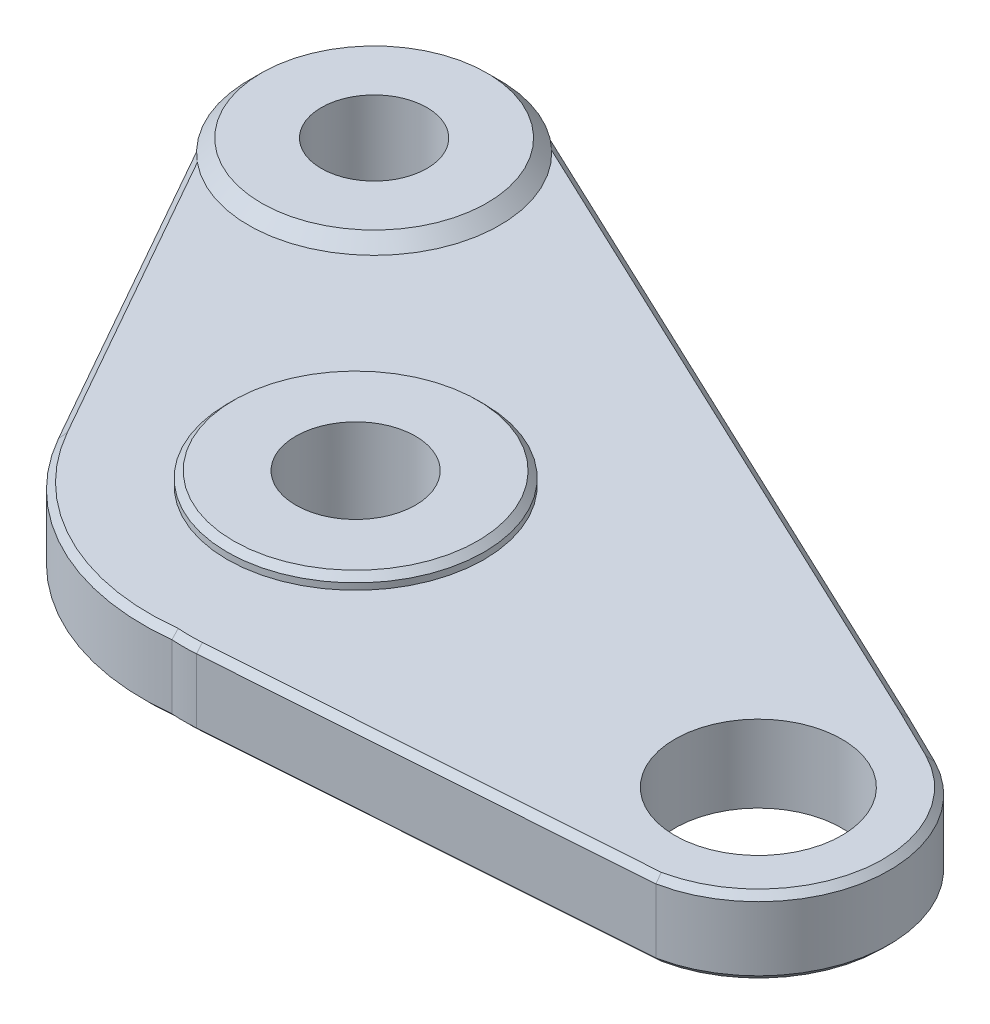
ISO-10303-21;
HEADER;
FILE_DESCRIPTION(('STEP AP214'),'2;1');
FILE_NAME('part.step','',(''),(''),'','','');
FILE_SCHEMA(('AUTOMOTIVE_DESIGN { 1 0 10303 214 1 1 1 1 }'));
ENDSEC;
DATA;
#1=APPLICATION_CONTEXT('core data for automotive mechanical design processes');
#2=APPLICATION_PROTOCOL_DEFINITION('international standard','automotive_design',2000,#1);
#3=PRODUCT_CONTEXT('',#1,'mechanical');
#4=PRODUCT('Part','Part','',(#3));
#5=PRODUCT_RELATED_PRODUCT_CATEGORY('part','',(#4));
#6=PRODUCT_DEFINITION_FORMATION('','',#4);
#7=PRODUCT_DEFINITION_CONTEXT('part definition',#1,'design');
#8=PRODUCT_DEFINITION('design','',#6,#7);
#9=PRODUCT_DEFINITION_SHAPE('','',#8);
#10=(LENGTH_UNIT() NAMED_UNIT(*) SI_UNIT(.MILLI.,.METRE.));
#11=(NAMED_UNIT(*) PLANE_ANGLE_UNIT() SI_UNIT($,.RADIAN.));
#12=(NAMED_UNIT(*) SI_UNIT($,.STERADIAN.) SOLID_ANGLE_UNIT());
#13=UNCERTAINTY_MEASURE_WITH_UNIT(LENGTH_MEASURE(1.E-05),#10,'distance_accuracy_value','');
#14=(GEOMETRIC_REPRESENTATION_CONTEXT(3) GLOBAL_UNCERTAINTY_ASSIGNED_CONTEXT((#13)) GLOBAL_UNIT_ASSIGNED_CONTEXT((#10,
#11,#12)) REPRESENTATION_CONTEXT('',''));
#15=CARTESIAN_POINT('',(0.,0.,0.));
#16=DIRECTION('',(0.,0.,1.));
#17=DIRECTION('',(1.,0.,0.));
#18=AXIS2_PLACEMENT_3D('',#15,#16,#17);
#19=CARTESIAN_POINT('',(-213.823755457334,3.,-894.549990164915));
#20=DIRECTION('',(0.,-1.,0.));
#21=DIRECTION('',(0.,0.,-1.));
#22=AXIS2_PLACEMENT_3D('',#19,#20,#21);
#23=CYLINDRICAL_SURFACE('',#22,2.329855648199);
#24=CARTESIAN_POINT('',(-213.823755457334,3.5,-894.549990164915));
#25=DIRECTION('',(0.,1.,0.));
#26=DIRECTION('',(0.,0.,1.));
#27=AXIS2_PLACEMENT_3D('',#24,#25,#26);
#28=CIRCLE('',#27,2.32985564819897);
#29=CARTESIAN_POINT('',(-213.823755457334,3.5,-892.220134516716));
#30=VERTEX_POINT('',#29);
#31=EDGE_CURVE('E444',#30,#30,#28,.T.);
#32=ORIENTED_EDGE('',*,*,#31,.T.);
#33=EDGE_LOOP('',(#32));
#34=FACE_BOUND('',#33,.T.);
#35=CARTESIAN_POINT('',(-213.823755457334,0.,-894.549990164915));
#36=DIRECTION('',(0.,-1.,0.));
#37=DIRECTION('',(0.,0.,-1.));
#38=AXIS2_PLACEMENT_3D('',#35,#36,#37);
#39=CIRCLE('',#38,2.32985564819897);
#40=CARTESIAN_POINT('',(-213.823755457334,0.,-896.879845813114));
#41=VERTEX_POINT('',#40);
#42=EDGE_CURVE('E451',#41,#41,#39,.T.);
#43=ORIENTED_EDGE('',*,*,#42,.T.);
#44=EDGE_LOOP('',(#43));
#45=FACE_BOUND('',#44,.T.);
#46=ADVANCED_FACE('F35',(#34,#45),#23,.F.);
#47=CARTESIAN_POINT('',(0.,0.,0.));
#48=DIRECTION('',(0.,1.,0.));
#49=DIRECTION('',(0.,0.,1.));
#50=AXIS2_PLACEMENT_3D('',#47,#48,#49);
#51=PLANE('',#50);
#52=CARTESIAN_POINT('',(-195.804631344532,0.,-892.212081269776));
#53=DIRECTION('',(0.,1.,0.));
#54=DIRECTION('',(0.,0.,1.));
#55=AXIS2_PLACEMENT_3D('',#52,#53,#54);
#56=CIRCLE('',#55,3.25135682008187);
#57=CARTESIAN_POINT('',(-195.804631344532,0.,-888.960724449694));
#58=VERTEX_POINT('',#57);
#59=EDGE_CURVE('E433',#58,#58,#56,.T.);
#60=ORIENTED_EDGE('',*,*,#59,.T.);
#61=EDGE_LOOP('',(#60));
#62=FACE_BOUND('',#61,.T.);
#63=CARTESIAN_POINT('',(-224.681131082097,0.,-906.127727053065));
#64=DIRECTION('',(0.,-1.,0.));
#65=DIRECTION('',(0.,0.,-1.));
#66=AXIS2_PLACEMENT_3D('',#63,#64,#65);
#67=CIRCLE('',#66,2.05670900357147);
#68=CARTESIAN_POINT('',(-224.681131082097,0.,-908.184436056637));
#69=VERTEX_POINT('',#68);
#70=EDGE_CURVE('E436',#69,#69,#67,.T.);
#71=ORIENTED_EDGE('',*,*,#70,.F.);
#72=EDGE_LOOP('',(#71));
#73=FACE_BOUND('',#72,.T.);
#74=CARTESIAN_POINT('',(-213.501473140802,0.,-895.082298661492));
#75=DIRECTION('',(0.,1.,0.));
#76=DIRECTION('',(0.,0.,1.));
#77=AXIS2_PLACEMENT_3D('',#74,#75,#76);
#78=CIRCLE('',#77,8.86940842638681);
#79=CARTESIAN_POINT('',(-212.455862171448,0.,-886.274739207544));
#80=VERTEX_POINT('',#79);
#81=CARTESIAN_POINT('',(-221.224016428551,0.,-890.720105290845));
#82=VERTEX_POINT('',#81);
#83=EDGE_CURVE('E514',#80,#82,#78,.F.);
#84=ORIENTED_EDGE('',*,*,#83,.T.);
#85=DIRECTION('',(-0.491824613428475,0.,-0.870694291715486));
#86=VECTOR('',#85,1.);
#87=CARTESIAN_POINT('',(213.720257906825,0.,-120.723064601422));
#88=LINE('',#87,#86);
#89=CARTESIAN_POINT('',(-229.225963751969,0.,-904.886232131346));
#90=VERTEX_POINT('',#89);
#91=EDGE_CURVE('E522',#82,#90,#88,.T.);
#92=ORIENTED_EDGE('',*,*,#91,.T.);
#93=CARTESIAN_POINT('',(-224.681131082097,0.,-906.127727053065));
#94=DIRECTION('',(0.,1.,0.));
#95=DIRECTION('',(0.,0.,1.));
#96=AXIS2_PLACEMENT_3D('',#93,#94,#95);
#97=CIRCLE('',#96,4.71134944976371);
#98=CARTESIAN_POINT('',(-223.430890142522,0.,-910.67016155791));
#99=VERTEX_POINT('',#98);
#100=EDGE_CURVE('E537',#90,#99,#97,.F.);
#101=ORIENTED_EDGE('',*,*,#100,.T.);
#102=DIRECTION('',(0.904115765446797,0.,0.42728758777965));
#103=VECTOR('',#102,1.);
#104=CARTESIAN_POINT('',(-195.549034801812,0.,-897.493120335245));
#105=LINE('',#104,#103);
#106=CARTESIAN_POINT('',(-195.550649035859,0.,-897.493883226678));
#107=VERTEX_POINT('',#106);
#108=EDGE_CURVE('E535',#99,#107,#105,.T.);
#109=ORIENTED_EDGE('',*,*,#108,.T.);
#110=DIRECTION('',(0.897920722726972,0.,0.440157217023045));
#111=VECTOR('',#110,1.);
#112=CARTESIAN_POINT('',(-193.602990997308,0.,-896.539148894055));
#113=LINE('',#112,#111);
#114=CARTESIAN_POINT('',(-193.604600848111,0.,-896.539938036606));
#115=VERTEX_POINT('',#114);
#116=EDGE_CURVE('E533',#107,#115,#113,.T.);
#117=ORIENTED_EDGE('',*,*,#116,.T.);
#118=CARTESIAN_POINT('',(-195.804631344532,0.,-892.212081269776));
#119=DIRECTION('',(0.,1.,0.));
#120=DIRECTION('',(0.,0.,1.));
#121=AXIS2_PLACEMENT_3D('',#118,#119,#120);
#122=CIRCLE('',#121,4.85494370506765);
#123=CARTESIAN_POINT('',(-194.82627024636,0.,-887.456738175849));
#124=VERTEX_POINT('',#123);
#125=EDGE_CURVE('E531',#115,#124,#122,.F.);
#126=ORIENTED_EDGE('',*,*,#125,.T.);
#127=DIRECTION('',(-0.997493341424186,0.,0.0707603972177353));
#128=VECTOR('',#127,1.);
#129=CARTESIAN_POINT('',(-211.5124776384,0.,-886.27304840662));
#130=LINE('',#129,#128);
#131=CARTESIAN_POINT('',(-211.5124776384,0.,-886.27304840662));
#132=VERTEX_POINT('',#131);
#133=EDGE_CURVE('E529',#124,#132,#130,.T.);
#134=ORIENTED_EDGE('',*,*,#133,.T.);
#135=CARTESIAN_POINT('',(-211.972547640031,0.,-892.758551332833));
#136=DIRECTION('',(0.,1.,0.));
#137=DIRECTION('',(0.,0.,1.));
#138=AXIS2_PLACEMENT_3D('',#135,#136,#137);
#139=CIRCLE('',#138,6.50180072074809);
#140=EDGE_CURVE('E519',#132,#80,#139,.F.);
#141=ORIENTED_EDGE('',*,*,#140,.T.);
#142=EDGE_LOOP('',(#84,#92,#101,#109,#117,#126,#134,#141));
#143=FACE_BOUND('',#142,.T.);
#144=ORIENTED_EDGE('',*,*,#42,.F.);
#145=EDGE_LOOP('',(#144));
#146=FACE_BOUND('',#145,.T.);
#147=ADVANCED_FACE('F341',(#62,#73,#143,#146),#51,.F.);
#148=CARTESIAN_POINT('',(0.,3.,0.));
#149=DIRECTION('',(0.,1.,0.));
#150=DIRECTION('',(0.,0.,1.));
#151=AXIS2_PLACEMENT_3D('',#148,#149,#150);
#152=PLANE('',#151);
#153=CARTESIAN_POINT('',(-213.823755457334,3.,-894.549990164915));
#154=DIRECTION('',(0.,1.,0.));
#155=DIRECTION('',(0.,0.,1.));
#156=AXIS2_PLACEMENT_3D('',#153,#154,#155);
#157=CIRCLE('',#156,4.99999999999999);
#158=CARTESIAN_POINT('',(-213.823755457334,3.,-889.549990164915));
#159=VERTEX_POINT('',#158);
#160=EDGE_CURVE('E441',#159,#159,#157,.T.);
#161=ORIENTED_EDGE('',*,*,#160,.F.);
#162=EDGE_LOOP('',(#161));
#163=FACE_BOUND('',#162,.T.);
#164=CARTESIAN_POINT('',(-195.804631344532,3.,-892.212081269776));
#165=DIRECTION('',(0.,1.,0.));
#166=DIRECTION('',(0.,0.,1.));
#167=AXIS2_PLACEMENT_3D('',#164,#165,#166);
#168=CIRCLE('',#167,3.25135682008187);
#169=CARTESIAN_POINT('',(-195.804631344532,3.,-888.960724449694));
#170=VERTEX_POINT('',#169);
#171=EDGE_CURVE('E432',#170,#170,#168,.T.);
#172=ORIENTED_EDGE('',*,*,#171,.F.);
#173=EDGE_LOOP('',(#172));
#174=FACE_BOUND('',#173,.T.);
#175=DIRECTION('',(-0.904115765446797,0.,-0.42728758777965));
#176=VECTOR('',#175,1.);
#177=CARTESIAN_POINT('',(311.014945720974,3.,-658.089595293655));
#178=LINE('',#177,#176);
#179=CARTESIAN_POINT('',(-195.550649035864,3.,-897.493883226681));
#180=VERTEX_POINT('',#179);
#181=CARTESIAN_POINT('',(-221.302349249794,3.,-909.664207300387));
#182=VERTEX_POINT('',#181);
#183=EDGE_CURVE('E175',#180,#182,#178,.T.);
#184=ORIENTED_EDGE('',*,*,#183,.T.);
#185=CARTESIAN_POINT('',(-224.681131082097,3.,-906.127727053065));
#186=DIRECTION('',(0.,1.,0.));
#187=DIRECTION('',(0.,0.,1.));
#188=AXIS2_PLACEMENT_3D('',#185,#186,#187);
#189=CIRCLE('',#188,4.89109999999994);
#190=CARTESIAN_POINT('',(-227.798127864473,3.,-902.358484387932));
#191=VERTEX_POINT('',#190);
#192=EDGE_CURVE('E50',#191,#182,#189,.T.);
#193=ORIENTED_EDGE('',*,*,#192,.F.);
#194=DIRECTION('',(0.491824613428475,0.,0.870694291715486));
#195=VECTOR('',#194,1.);
#196=CARTESIAN_POINT('',(-221.22401642855,3.,-890.720105290845));
#197=LINE('',#196,#195);
#198=CARTESIAN_POINT('',(-221.22401642855,3.,-890.720105290845));
#199=VERTEX_POINT('',#198);
#200=EDGE_CURVE('E174',#191,#199,#197,.T.);
#201=ORIENTED_EDGE('',*,*,#200,.T.);
#202=CARTESIAN_POINT('',(-213.501473140802,3.,-895.082298661492));
#203=DIRECTION('',(0.,1.,0.));
#204=DIRECTION('',(0.,0.,1.));
#205=AXIS2_PLACEMENT_3D('',#202,#203,#204);
#206=CIRCLE('',#205,8.86940842638675);
#207=CARTESIAN_POINT('',(-212.455862171448,3.,-886.274739207544));
#208=VERTEX_POINT('',#207);
#209=EDGE_CURVE('E189',#199,#208,#206,.T.);
#210=ORIENTED_EDGE('',*,*,#209,.T.);
#211=CARTESIAN_POINT('',(-211.972547640031,3.,-892.758551332833));
#212=DIRECTION('',(0.,1.,0.));
#213=DIRECTION('',(0.,0.,1.));
#214=AXIS2_PLACEMENT_3D('',#211,#212,#213);
#215=CIRCLE('',#214,6.50180072074809);
#216=CARTESIAN_POINT('',(-211.5124776384,3.,-886.27304840662));
#217=VERTEX_POINT('',#216);
#218=EDGE_CURVE('E191',#208,#217,#215,.T.);
#219=ORIENTED_EDGE('',*,*,#218,.T.);
#220=DIRECTION('',(0.997493341424186,0.,-0.0707603972177353));
#221=VECTOR('',#220,1.);
#222=CARTESIAN_POINT('',(-63.614882914475,3.,-896.764639794358));
#223=LINE('',#222,#221);
#224=CARTESIAN_POINT('',(-194.82627024636,3.,-887.456738175849));
#225=VERTEX_POINT('',#224);
#226=EDGE_CURVE('E193',#217,#225,#223,.T.);
#227=ORIENTED_EDGE('',*,*,#226,.T.);
#228=CARTESIAN_POINT('',(-195.804631344532,3.,-892.212081269776));
#229=DIRECTION('',(0.,1.,0.));
#230=DIRECTION('',(0.,0.,1.));
#231=AXIS2_PLACEMENT_3D('',#228,#229,#230);
#232=CIRCLE('',#231,4.85494370506764);
#233=CARTESIAN_POINT('',(-193.604600848106,3.,-896.539938036603));
#234=VERTEX_POINT('',#233);
#235=EDGE_CURVE('E195',#225,#234,#232,.T.);
#236=ORIENTED_EDGE('',*,*,#235,.T.);
#237=DIRECTION('',(-0.897920722726972,0.,-0.440157217023045));
#238=VECTOR('',#237,1.);
#239=CARTESIAN_POINT('',(316.827509444087,3.,-646.328119265909));
#240=LINE('',#239,#238);
#241=EDGE_CURVE('E197',#234,#180,#240,.T.);
#242=ORIENTED_EDGE('',*,*,#241,.T.);
#243=EDGE_LOOP('',(#184,#193,#201,#210,#219,#227,#236,#242));
#244=FACE_BOUND('',#243,.T.);
#245=ADVANCED_FACE('F347',(#163,#174,#244),#152,.T.);
#246=CARTESIAN_POINT('',(-224.681131082097,3.,-906.127727053065));
#247=DIRECTION('',(0.,-1.,0.));
#248=DIRECTION('',(0.,0.,-1.));
#249=AXIS2_PLACEMENT_3D('',#246,#247,#248);
#250=CYLINDRICAL_SURFACE('',#249,2.05670900357144);
#251=ORIENTED_EDGE('',*,*,#70,.T.);
#252=EDGE_LOOP('',(#251));
#253=FACE_BOUND('',#252,.T.);
#254=CARTESIAN_POINT('',(-224.681131082097,3.5,-906.127727053065));
#255=DIRECTION('',(0.,1.,0.));
#256=DIRECTION('',(0.,0.,1.));
#257=AXIS2_PLACEMENT_3D('',#254,#255,#256);
#258=CIRCLE('',#257,2.05670900357144);
#259=CARTESIAN_POINT('',(-224.681131082097,3.5,-904.071018049494));
#260=VERTEX_POINT('',#259);
#261=EDGE_CURVE('E448',#260,#260,#258,.T.);
#262=ORIENTED_EDGE('',*,*,#261,.T.);
#263=EDGE_LOOP('',(#262));
#264=FACE_BOUND('',#263,.T.);
#265=ADVANCED_FACE('F354',(#253,#264),#250,.F.);
#266=CARTESIAN_POINT('',(-213.501473140802,3.,-895.082298661492));
#267=DIRECTION('',(0.,-1.,0.));
#268=DIRECTION('',(0.,0.,-1.));
#269=AXIS2_PLACEMENT_3D('',#266,#267,#268);
#270=CYLINDRICAL_SURFACE('',#269,9.11940842638678);
#271=DIRECTION('',(0.,-1.,0.));
#272=VECTOR('',#271,1.);
#273=CARTESIAN_POINT('',(-221.441690001479,3.,-890.597149137488));
#274=LINE('',#273,#272);
#275=CARTESIAN_POINT('',(-221.441690001479,2.75000000000011,-890.597149137488));
#276=VERTEX_POINT('',#275);
#277=CARTESIAN_POINT('',(-221.441690001479,0.250000000000015,-890.597149137488));
#278=VERTEX_POINT('',#277);
#279=EDGE_CURVE('E429',#276,#278,#274,.T.);
#280=ORIENTED_EDGE('',*,*,#279,.T.);
#281=CARTESIAN_POINT('',(-213.501473140802,0.250000000000015,-895.082298661492));
#282=DIRECTION('',(0.,1.,0.));
#283=DIRECTION('',(0.,0.,1.));
#284=AXIS2_PLACEMENT_3D('',#281,#282,#283);
#285=CIRCLE('',#284,9.11940842638678);
#286=CARTESIAN_POINT('',(-212.450307740966,0.250000000000015,-886.023675071264));
#287=VERTEX_POINT('',#286);
#288=EDGE_CURVE('E512',#278,#287,#285,.T.);
#289=ORIENTED_EDGE('',*,*,#288,.T.);
#290=DIRECTION('',(0.,-1.,0.));
#291=VECTOR('',#290,1.);
#292=CARTESIAN_POINT('',(-212.450307740966,3.,-886.023675071264));
#293=LINE('',#292,#291);
#294=CARTESIAN_POINT('',(-212.450307740966,2.75000000000008,-886.023675071264));
#295=VERTEX_POINT('',#294);
#296=EDGE_CURVE('E406',#295,#287,#293,.T.);
#297=ORIENTED_EDGE('',*,*,#296,.F.);
#298=CARTESIAN_POINT('',(-213.501473140802,2.75000000000008,-895.082298661492));
#299=DIRECTION('',(0.,1.,0.));
#300=DIRECTION('',(0.,0.,1.));
#301=AXIS2_PLACEMENT_3D('',#298,#299,#300);
#302=CIRCLE('',#301,9.11940842638678);
#303=EDGE_CURVE('E206',#295,#276,#302,.F.);
#304=ORIENTED_EDGE('',*,*,#303,.T.);
#305=EDGE_LOOP('',(#280,#289,#297,#304));
#306=FACE_BOUND('',#305,.T.);
#307=ADVANCED_FACE('F383',(#306),#270,.T.);
#308=CARTESIAN_POINT('',(-211.972547640031,3.,-892.758551332833));
#309=DIRECTION('',(0.,-1.,0.));
#310=DIRECTION('',(0.,0.,-1.));
#311=AXIS2_PLACEMENT_3D('',#308,#309,#310);
#312=CYLINDRICAL_SURFACE('',#311,6.75180072074806);
#313=ORIENTED_EDGE('',*,*,#296,.T.);
#314=CARTESIAN_POINT('',(-211.972547640031,0.250000000000015,-892.758551332833));
#315=DIRECTION('',(0.,1.,0.));
#316=DIRECTION('',(0.,0.,1.));
#317=AXIS2_PLACEMENT_3D('',#314,#315,#316);
#318=CIRCLE('',#317,6.75180072074806);
#319=CARTESIAN_POINT('',(-211.494787539096,0.250000000000013,-886.023675071264));
#320=VERTEX_POINT('',#319);
#321=EDGE_CURVE('E497',#287,#320,#318,.T.);
#322=ORIENTED_EDGE('',*,*,#321,.T.);
#323=DIRECTION('',(0.,-1.,0.));
#324=VECTOR('',#323,1.);
#325=CARTESIAN_POINT('',(-211.494787539096,3.,-886.023675071264));
#326=LINE('',#325,#324);
#327=CARTESIAN_POINT('',(-211.494787539096,2.75000000000008,-886.023675071264));
#328=VERTEX_POINT('',#327);
#329=EDGE_CURVE('E409',#328,#320,#326,.T.);
#330=ORIENTED_EDGE('',*,*,#329,.F.);
#331=CARTESIAN_POINT('',(-211.972547640031,2.75000000000008,-892.758551332833));
#332=DIRECTION('',(0.,1.,0.));
#333=DIRECTION('',(0.,0.,1.));
#334=AXIS2_PLACEMENT_3D('',#331,#332,#333);
#335=CIRCLE('',#334,6.75180072074806);
#336=EDGE_CURVE('E204',#328,#295,#335,.F.);
#337=ORIENTED_EDGE('',*,*,#336,.T.);
#338=EDGE_LOOP('',(#313,#322,#330,#337));
#339=FACE_BOUND('',#338,.T.);
#340=ADVANCED_FACE('F379',(#339),#312,.T.);
#341=CARTESIAN_POINT('',(-63.5971928151706,3.,-896.515266459002));
#342=DIRECTION('',(0.0707603972177353,0.,0.997493341424186));
#343=DIRECTION('',(0.997493341424186,0.,-0.0707603972177353));
#344=AXIS2_PLACEMENT_3D('',#341,#342,#343);
#345=PLANE('',#344);
#346=ORIENTED_EDGE('',*,*,#329,.T.);
#347=DIRECTION('',(0.997493341424186,0.,-0.0707603972177353));
#348=VECTOR('',#347,1.);
#349=CARTESIAN_POINT('',(-194.792294410404,0.250000000000013,-887.208520121583));
#350=LINE('',#349,#348);
#351=CARTESIAN_POINT('',(-194.792294410404,0.250000000000015,-887.208520121583));
#352=VERTEX_POINT('',#351);
#353=EDGE_CURVE('E493',#320,#352,#350,.T.);
#354=ORIENTED_EDGE('',*,*,#353,.T.);
#355=DIRECTION('',(0.,-1.,0.));
#356=VECTOR('',#355,1.);
#357=CARTESIAN_POINT('',(-194.792294410404,3.,-887.208520121583));
#358=LINE('',#357,#356);
#359=CARTESIAN_POINT('',(-194.792294410404,2.75000000000008,-887.208520121583));
#360=VERTEX_POINT('',#359);
#361=EDGE_CURVE('E414',#360,#352,#358,.T.);
#362=ORIENTED_EDGE('',*,*,#361,.F.);
#363=DIRECTION('',(-0.997493341424186,0.,0.0707603972177353));
#364=VECTOR('',#363,1.);
#365=CARTESIAN_POINT('',(-63.5971928151706,2.75000000000008,-896.515266459002));
#366=LINE('',#365,#364);
#367=EDGE_CURVE('E202',#360,#328,#366,.T.);
#368=ORIENTED_EDGE('',*,*,#367,.T.);
#369=EDGE_LOOP('',(#346,#354,#362,#368));
#370=FACE_BOUND('',#369,.T.);
#371=ADVANCED_FACE('F375',(#370),#345,.T.);
#372=CARTESIAN_POINT('',(-195.804631344532,3.,-892.212081269776));
#373=DIRECTION('',(0.,-1.,0.));
#374=DIRECTION('',(0.,0.,-1.));
#375=AXIS2_PLACEMENT_3D('',#372,#373,#374);
#376=CYLINDRICAL_SURFACE('',#375,5.10494370506767);
#377=ORIENTED_EDGE('',*,*,#361,.T.);
#378=CARTESIAN_POINT('',(-195.804631344532,0.250000000000015,-892.212081269776));
#379=DIRECTION('',(0.,1.,0.));
#380=DIRECTION('',(0.,0.,1.));
#381=AXIS2_PLACEMENT_3D('',#378,#379,#380);
#382=CIRCLE('',#381,5.10494370506767);
#383=CARTESIAN_POINT('',(-193.492951693052,0.249999999999989,-896.763629074737));
#384=VERTEX_POINT('',#383);
#385=EDGE_CURVE('E489',#352,#384,#382,.T.);
#386=ORIENTED_EDGE('',*,*,#385,.T.);
#387=DIRECTION('',(0.,-1.,0.));
#388=VECTOR('',#387,1.);
#389=CARTESIAN_POINT('',(-193.492951693052,3.,-896.763629074737));
#390=LINE('',#389,#388);
#391=CARTESIAN_POINT('',(-193.492951693052,2.75000000000008,-896.763629074737));
#392=VERTEX_POINT('',#391);
#393=EDGE_CURVE('E417',#392,#384,#390,.T.);
#394=ORIENTED_EDGE('',*,*,#393,.F.);
#395=CARTESIAN_POINT('',(-195.804631344532,2.75000000000008,-892.212081269776));
#396=DIRECTION('',(0.,1.,0.));
#397=DIRECTION('',(0.,0.,1.));
#398=AXIS2_PLACEMENT_3D('',#395,#396,#397);
#399=CIRCLE('',#398,5.10494370506767);
#400=EDGE_CURVE('E200',#392,#360,#399,.F.);
#401=ORIENTED_EDGE('',*,*,#400,.T.);
#402=EDGE_LOOP('',(#377,#386,#394,#401));
#403=FACE_BOUND('',#402,.T.);
#404=ADVANCED_FACE('F371',(#403),#376,.T.);
#405=CARTESIAN_POINT('',(316.937548748343,3.,-646.552599446591));
#406=DIRECTION('',(0.440157217023045,0.,-0.897920722726972));
#407=DIRECTION('',(-0.897920722726972,0.,-0.440157217023045));
#408=AXIS2_PLACEMENT_3D('',#405,#406,#407);
#409=PLANE('',#408);
#410=ORIENTED_EDGE('',*,*,#393,.T.);
#411=DIRECTION('',(-0.897920722726972,0.,-0.440157217023045));
#412=VECTOR('',#411,1.);
#413=CARTESIAN_POINT('',(-195.442212904867,0.249999999999988,-897.719149276607));
#414=LINE('',#413,#412);
#415=CARTESIAN_POINT('',(-195.442212904867,0.250000000000024,-897.719149276607));
#416=VERTEX_POINT('',#415);
#417=EDGE_CURVE('E492',#384,#416,#414,.T.);
#418=ORIENTED_EDGE('',*,*,#417,.T.);
#419=DIRECTION('',(0.,-1.,0.));
#420=VECTOR('',#419,1.);
#421=CARTESIAN_POINT('',(-195.442212904867,3.,-897.719149276607));
#422=LINE('',#421,#420);
#423=CARTESIAN_POINT('',(-195.442212904867,2.75000000000004,-897.719149276607));
#424=VERTEX_POINT('',#423);
#425=EDGE_CURVE('E420',#424,#416,#422,.T.);
#426=ORIENTED_EDGE('',*,*,#425,.F.);
#427=DIRECTION('',(0.897920722726972,0.,0.440157217023045));
#428=VECTOR('',#427,1.);
#429=CARTESIAN_POINT('',(316.937548748343,2.75000000000009,-646.552599446591));
#430=LINE('',#429,#428);
#431=EDGE_CURVE('E180',#424,#392,#430,.T.);
#432=ORIENTED_EDGE('',*,*,#431,.T.);
#433=EDGE_LOOP('',(#410,#418,#426,#432));
#434=FACE_BOUND('',#433,.T.);
#435=ADVANCED_FACE('F367',(#434),#409,.T.);
#436=CARTESIAN_POINT('',(311.121767617919,3.,-658.315624235017));
#437=DIRECTION('',(0.42728758777965,0.,-0.904115765446797));
#438=DIRECTION('',(-0.904115765446797,0.,-0.42728758777965));
#439=AXIS2_PLACEMENT_3D('',#436,#437,#438);
#440=PLANE('',#439);
#441=ORIENTED_EDGE('',*,*,#425,.T.);
#442=DIRECTION('',(-0.904115765446797,0.,-0.42728758777965));
#443=VECTOR('',#442,1.);
#444=CARTESIAN_POINT('',(-223.343402799478,0.250000000000023,-910.905328062416));
#445=LINE('',#444,#443);
#446=CARTESIAN_POINT('',(-223.343402799478,0.250000000000015,-910.905328062416));
#447=VERTEX_POINT('',#446);
#448=EDGE_CURVE('E495',#416,#447,#445,.T.);
#449=ORIENTED_EDGE('',*,*,#448,.T.);
#450=DIRECTION('',(0.,-1.,0.));
#451=VECTOR('',#450,1.);
#452=CARTESIAN_POINT('',(-223.343402799478,3.,-910.905328062416));
#453=LINE('',#452,#451);
#454=CARTESIAN_POINT('',(-223.343402799478,2.75000000000004,-910.905328062416));
#455=VERTEX_POINT('',#454);
#456=EDGE_CURVE('E423',#455,#447,#453,.T.);
#457=ORIENTED_EDGE('',*,*,#456,.F.);
#458=DIRECTION('',(0.904115765446797,0.,0.42728758777965));
#459=VECTOR('',#458,1.);
#460=CARTESIAN_POINT('',(311.121767617919,2.75000000000004,-658.315624235017));
#461=LINE('',#460,#459);
#462=EDGE_CURVE('E160',#455,#424,#461,.T.);
#463=ORIENTED_EDGE('',*,*,#462,.T.);
#464=EDGE_LOOP('',(#441,#449,#457,#463));
#465=FACE_BOUND('',#464,.T.);
#466=ADVANCED_FACE('F363',(#465),#440,.T.);
#467=CARTESIAN_POINT('',(-224.681131082097,3.,-906.127727053065));
#468=DIRECTION('',(0.,-1.,0.));
#469=DIRECTION('',(0.,0.,-1.));
#470=AXIS2_PLACEMENT_3D('',#467,#468,#469);
#471=CYLINDRICAL_SURFACE('',#470,4.96134944976373);
#472=ORIENTED_EDGE('',*,*,#456,.T.);
#473=CARTESIAN_POINT('',(-224.681131082097,0.250000000000015,-906.127727053065));
#474=DIRECTION('',(0.,1.,0.));
#475=DIRECTION('',(0.,0.,1.));
#476=AXIS2_PLACEMENT_3D('',#473,#474,#475);
#477=CIRCLE('',#476,4.96134944976373);
#478=CARTESIAN_POINT('',(-229.458732091448,0.250000000000015,-904.789998770447));
#479=VERTEX_POINT('',#478);
#480=EDGE_CURVE('E43',#447,#479,#477,.T.);
#481=ORIENTED_EDGE('',*,*,#480,.T.);
#482=DIRECTION('',(0.,-1.,0.));
#483=VECTOR('',#482,1.);
#484=CARTESIAN_POINT('',(-229.458732091448,3.,-904.789998770447));
#485=LINE('',#484,#483);
#486=CARTESIAN_POINT('',(-229.458732091448,2.75000000000008,-904.789998770447));
#487=VERTEX_POINT('',#486);
#488=EDGE_CURVE('E426',#487,#479,#485,.T.);
#489=ORIENTED_EDGE('',*,*,#488,.F.);
#490=CARTESIAN_POINT('',(-224.681131082097,2.75000000000008,-906.127727053065));
#491=DIRECTION('',(0.,1.,0.));
#492=DIRECTION('',(0.,0.,1.));
#493=AXIS2_PLACEMENT_3D('',#490,#491,#492);
#494=CIRCLE('',#493,4.96134944976373);
#495=EDGE_CURVE('E210',#487,#455,#494,.F.);
#496=ORIENTED_EDGE('',*,*,#495,.T.);
#497=EDGE_LOOP('',(#472,#481,#489,#496));
#498=FACE_BOUND('',#497,.T.);
#499=ADVANCED_FACE('F359',(#498),#471,.T.);
#500=CARTESIAN_POINT('',(213.502584333896,3.,-120.600108448065));
#501=DIRECTION('',(0.870694291715486,0.,-0.491824613428475));
#502=DIRECTION('',(-0.491824613428475,0.,-0.870694291715486));
#503=AXIS2_PLACEMENT_3D('',#500,#501,#502);
#504=PLANE('',#503);
#505=ORIENTED_EDGE('',*,*,#488,.T.);
#506=DIRECTION('',(0.491824613428475,0.,0.870694291715486));
#507=VECTOR('',#506,1.);
#508=CARTESIAN_POINT('',(213.502584333896,0.249999999999991,-120.600108448065));
#509=LINE('',#508,#507);
#510=EDGE_CURVE('E213',#479,#278,#509,.T.);
#511=ORIENTED_EDGE('',*,*,#510,.T.);
#512=ORIENTED_EDGE('',*,*,#279,.F.);
#513=DIRECTION('',(-0.491824613428475,0.,-0.870694291715486));
#514=VECTOR('',#513,1.);
#515=CARTESIAN_POINT('',(-229.458732091448,2.75000000000011,-904.789998770447));
#516=LINE('',#515,#514);
#517=EDGE_CURVE('E208',#276,#487,#516,.T.);
#518=ORIENTED_EDGE('',*,*,#517,.T.);
#519=EDGE_LOOP('',(#505,#511,#512,#518));
#520=FACE_BOUND('',#519,.T.);
#521=ADVANCED_FACE('F355',(#520),#504,.F.);
#522=CARTESIAN_POINT('',(-195.804631344532,3.,-892.212081269776));
#523=DIRECTION('',(0.,-1.,0.));
#524=DIRECTION('',(0.,0.,-1.));
#525=AXIS2_PLACEMENT_3D('',#522,#523,#524);
#526=CYLINDRICAL_SURFACE('',#525,3.25135682008187);
#527=ORIENTED_EDGE('',*,*,#171,.T.);
#528=EDGE_LOOP('',(#527));
#529=FACE_BOUND('',#528,.T.);
#530=ORIENTED_EDGE('',*,*,#59,.F.);
#531=EDGE_LOOP('',(#530));
#532=FACE_BOUND('',#531,.T.);
#533=ADVANCED_FACE('F358',(#529,#532),#526,.F.);
#534=CARTESIAN_POINT('',(-213.823755457334,3.5,-894.549990164915));
#535=DIRECTION('',(0.,1.,0.));
#536=DIRECTION('',(0.,0.,1.));
#537=AXIS2_PLACEMENT_3D('',#534,#535,#536);
#538=PLANE('',#537);
#539=CARTESIAN_POINT('',(-213.823755457334,3.5,-894.549990164915));
#540=DIRECTION('',(0.,1.,0.));
#541=DIRECTION('',(0.,0.,1.));
#542=AXIS2_PLACEMENT_3D('',#539,#540,#541);
#543=CIRCLE('',#542,4.75000000000003);
#544=CARTESIAN_POINT('',(-213.823755457334,3.5,-889.799990164915));
#545=VERTEX_POINT('',#544);
#546=EDGE_CURVE('E404',#545,#545,#543,.T.);
#547=ORIENTED_EDGE('',*,*,#546,.T.);
#548=EDGE_LOOP('',(#547));
#549=FACE_BOUND('',#548,.T.);
#550=ORIENTED_EDGE('',*,*,#31,.F.);
#551=EDGE_LOOP('',(#550));
#552=FACE_BOUND('',#551,.T.);
#553=ADVANCED_FACE('F389',(#549,#552),#538,.T.);
#554=CARTESIAN_POINT('',(-213.823755457334,3.5,-894.549990164915));
#555=DIRECTION('',(0.,-1.,0.));
#556=DIRECTION('',(0.,0.,-1.));
#557=AXIS2_PLACEMENT_3D('',#554,#555,#556);
#558=CYLINDRICAL_SURFACE('',#557,4.99999999999999);
#559=CARTESIAN_POINT('',(-213.823755457334,3.25000000000001,-894.549990164915));
#560=DIRECTION('',(0.,1.,0.));
#561=DIRECTION('',(0.,0.,1.));
#562=AXIS2_PLACEMENT_3D('',#559,#560,#561);
#563=CIRCLE('',#562,4.99999999999999);
#564=CARTESIAN_POINT('',(-213.823755457334,3.25000000000001,-889.549990164915));
#565=VERTEX_POINT('',#564);
#566=EDGE_CURVE('E183',#565,#565,#563,.F.);
#567=ORIENTED_EDGE('',*,*,#566,.T.);
#568=EDGE_LOOP('',(#567));
#569=FACE_BOUND('',#568,.T.);
#570=ORIENTED_EDGE('',*,*,#160,.T.);
#571=EDGE_LOOP('',(#570));
#572=FACE_BOUND('',#571,.T.);
#573=ADVANCED_FACE('F392',(#569,#572),#558,.T.);
#574=CARTESIAN_POINT('',(-213.823755457334,3.5,-894.549990164915));
#575=DIRECTION('',(0.,-1.,0.));
#576=DIRECTION('',(0.,0.,-1.));
#577=AXIS2_PLACEMENT_3D('',#574,#575,#576);
#578=CONICAL_SURFACE('',#577,4.75000000000003,0.785398163397386);
#579=ORIENTED_EDGE('',*,*,#566,.F.);
#580=EDGE_LOOP('',(#579));
#581=FACE_BOUND('',#580,.T.);
#582=ORIENTED_EDGE('',*,*,#546,.F.);
#583=EDGE_LOOP('',(#582));
#584=FACE_BOUND('',#583,.T.);
#585=ADVANCED_FACE('F275',(#581,#584),#578,.T.);
#586=CARTESIAN_POINT('',(-213.501473140802,2.75000000000008,-895.082298661492));
#587=DIRECTION('',(0.,-1.,0.));
#588=DIRECTION('',(0.,0.,-1.));
#589=AXIS2_PLACEMENT_3D('',#586,#587,#588);
#590=CONICAL_SURFACE('',#589,9.11940842638678,0.785398163397587);
#591=CARTESIAN_POINT('',(-212.450307740966,2.75000000000008,-886.023675071264));
#592=CARTESIAN_POINT('',(-212.451243281467,2.79166976026542,-886.065515796613));
#593=CARTESIAN_POINT('',(-212.452173920924,2.83333797372618,-886.107358170639));
#594=CARTESIAN_POINT('',(-212.454025397752,2.9166713070595,-886.191046216066));
#595=CARTESIAN_POINT('',(-212.454946235122,2.95833642693206,-886.232891887467));
#596=CARTESIAN_POINT('',(-212.455862171448,3.00000000000002,-886.274739207544));
#597=B_SPLINE_CURVE_WITH_KNOTS('',3,(#591,#592,#593,#594,#595,#596),.UNSPECIFIED.,.F.,.F.,(4,2,
4),(0.,0.177175092217931,0.354350184525061),.UNSPECIFIED.);
#598=EDGE_CURVE('E261',#208,#295,#597,.F.);
#599=ORIENTED_EDGE('',*,*,#598,.F.);
#600=ORIENTED_EDGE('',*,*,#209,.F.);
#601=DIRECTION('',(0.615673838012586,0.707106781186409,-0.347772519309746));
#602=VECTOR('',#601,1.);
#603=CARTESIAN_POINT('',(-221.441690001479,2.75000000000008,-890.597149137488));
#604=LINE('',#603,#602);
#605=EDGE_CURVE('E268',#276,#199,#604,.T.);
#606=ORIENTED_EDGE('',*,*,#605,.F.);
#607=ORIENTED_EDGE('',*,*,#303,.F.);
#608=EDGE_LOOP('',(#599,#600,#606,#607));
#609=FACE_BOUND('',#608,.T.);
#610=ADVANCED_FACE('F271',(#609),#590,.T.);
#611=CARTESIAN_POINT('',(213.720257906825,3.,-120.723064601422));
#612=DIRECTION('',(-0.615673838012317,0.707106781186686,0.347772519309659));
#613=DIRECTION('',(-0.491824613428475,0.,-0.870694291715486));
#614=AXIS2_PLACEMENT_3D('',#611,#612,#613);
#615=PLANE('',#614);
#616=ORIENTED_EDGE('',*,*,#605,.T.);
#617=ORIENTED_EDGE('',*,*,#200,.F.);
#618=CARTESIAN_POINT('',(-229.225963751969,3.,-904.886232131347));
#619=VERTEX_POINT('',#618);
#620=EDGE_CURVE('E187',#619,#191,#197,.T.);
#621=ORIENTED_EDGE('',*,*,#620,.F.);
#622=CARTESIAN_POINT('',(-229.458732091448,2.75000000000009,-904.789998770447));
#623=CARTESIAN_POINT('',(-229.419966568749,2.79167075499785,-904.80609767126));
#624=CARTESIAN_POINT('',(-229.381186445937,2.83333946565806,-904.822166568342));
#625=CARTESIAN_POINT('',(-229.303596999445,2.91667279899143,-904.854244355309));
#626=CARTESIAN_POINT('',(-229.264787675764,2.95833742166452,-904.870253245194));
#627=CARTESIAN_POINT('',(-229.225963751969,3.,-904.886232131347));
#628=B_SPLINE_CURVE_WITH_KNOTS('',3,(#622,#623,#624,#625,#626,#627),.UNSPECIFIED.,.F.,.F.,(4,2,
4),(0.,0.177441538095385,0.354883079120866),.UNSPECIFIED.);
#629=EDGE_CURVE('E171',#487,#619,#628,.T.);
#630=ORIENTED_EDGE('',*,*,#629,.F.);
#631=ORIENTED_EDGE('',*,*,#517,.F.);
#632=EDGE_LOOP('',(#616,#617,#621,#630,#631));
#633=FACE_BOUND('',#632,.T.);
#634=ADVANCED_FACE('F253',(#633),#615,.T.);
#635=CARTESIAN_POINT('',(-211.972547640031,2.75000000000008,-892.758551332833));
#636=DIRECTION('',(0.,-1.,0.));
#637=DIRECTION('',(0.,0.,-1.));
#638=AXIS2_PLACEMENT_3D('',#635,#636,#637);
#639=CONICAL_SURFACE('',#638,6.75180072074806,0.785398163397547);
#640=ORIENTED_EDGE('',*,*,#598,.T.);
#641=ORIENTED_EDGE('',*,*,#336,.F.);
#642=DIRECTION('',(0.0500351567121435,-0.70710678118648,0.705334305909536));
#643=VECTOR('',#642,1.);
#644=CARTESIAN_POINT('',(-211.5124776384,3.,-886.27304840662));
#645=LINE('',#644,#643);
#646=EDGE_CURVE('E163',#217,#328,#645,.T.);
#647=ORIENTED_EDGE('',*,*,#646,.F.);
#648=ORIENTED_EDGE('',*,*,#218,.F.);
#649=EDGE_LOOP('',(#640,#641,#647,#648));
#650=FACE_BOUND('',#649,.T.);
#651=ADVANCED_FACE('F252',(#650),#639,.T.);
#652=CARTESIAN_POINT('',(-224.681131082097,2.75000000000008,-906.127727053065));
#653=DIRECTION('',(0.,-1.,0.));
#654=DIRECTION('',(0.,0.,-1.));
#655=AXIS2_PLACEMENT_3D('',#652,#653,#654);
#656=CONICAL_SURFACE('',#655,4.96134944976373,0.785398163397578);
#657=ORIENTED_EDGE('',*,*,#629,.T.);
#658=CARTESIAN_POINT('',(-224.681131082097,3.,-906.127727053065));
#659=DIRECTION('',(0.,1.,0.));
#660=DIRECTION('',(0.,0.,1.));
#661=AXIS2_PLACEMENT_3D('',#658,#659,#660);
#662=CIRCLE('',#661,4.71134944976374);
#663=CARTESIAN_POINT('',(-223.430890142523,3.,-910.67016155791));
#664=VERTEX_POINT('',#663);
#665=EDGE_CURVE('E168',#664,#619,#662,.T.);
#666=ORIENTED_EDGE('',*,*,#665,.F.);
#667=CARTESIAN_POINT('',(-223.343402799478,2.75000000000006,-910.905328062416));
#668=CARTESIAN_POINT('',(-223.358026670336,2.79166864399119,-910.86615161307));
#669=CARTESIAN_POINT('',(-223.372629217656,2.83333629923721,-910.826966179766));
#670=CARTESIAN_POINT('',(-223.401791665338,2.91666963257052,-910.74857734493));
#671=CARTESIAN_POINT('',(-223.416351565699,2.9583353106578,-910.709373943399));
#672=CARTESIAN_POINT('',(-223.430890142522,2.99999999999995,-910.67016155791));
#673=B_SPLINE_CURVE_WITH_KNOTS('',3,(#667,#668,#669,#670,#671,#672),.UNSPECIFIED.,.F.,.F.,(4,2,
4),(0.,0.177099787087873,0.354199575584897),.UNSPECIFIED.);
#674=EDGE_CURVE('E153',#455,#664,#673,.T.);
#675=ORIENTED_EDGE('',*,*,#674,.F.);
#676=ORIENTED_EDGE('',*,*,#495,.F.);
#677=EDGE_LOOP('',(#657,#666,#675,#676));
#678=FACE_BOUND('',#677,.T.);
#679=ADVANCED_FACE('F169',(#678),#656,.T.);
#680=CARTESIAN_POINT('',(-63.5971928151706,2.75000000000008,-896.515266459002));
#681=DIRECTION('',(-0.0500351567121096,-0.707106781186614,-0.705334305909404));
#682=DIRECTION('',(-0.997493341424186,0.,0.0707603972177353));
#683=AXIS2_PLACEMENT_3D('',#680,#681,#682);
#684=PLANE('',#683);
#685=ORIENTED_EDGE('',*,*,#646,.T.);
#686=ORIENTED_EDGE('',*,*,#367,.F.);
#687=CARTESIAN_POINT('',(-194.792294410404,2.75000000000008,-887.208520121583));
#688=CARTESIAN_POINT('',(-194.797922985665,2.79166778426724,-887.249893334147));
#689=CARTESIAN_POINT('',(-194.803568592952,2.83333500969003,-887.291264778241));
#690=CARTESIAN_POINT('',(-194.814893871604,2.91666834302336,-887.374004129663));
#691=CARTESIAN_POINT('',(-194.820573542969,2.95833445093389,-887.415372036991));
#692=CARTESIAN_POINT('',(-194.82627024636,3.00000000000004,-887.456738175849));
#693=B_SPLINE_CURVE_WITH_KNOTS('',3,(#687,#688,#689,#690,#691,#692),.UNSPECIFIED.,.F.,.F.,(4,2,
4),(0.,0.176965088314878,0.353930177379299),.UNSPECIFIED.);
#694=EDGE_CURVE('E164',#225,#360,#693,.F.);
#695=ORIENTED_EDGE('',*,*,#694,.F.);
#696=ORIENTED_EDGE('',*,*,#226,.F.);
#697=EDGE_LOOP('',(#685,#686,#695,#696));
#698=FACE_BOUND('',#697,.T.);
#699=ADVANCED_FACE('F233',(#698),#684,.F.);
#700=CARTESIAN_POINT('',(311.121767617919,2.75000000000008,-658.315624235017));
#701=DIRECTION('',(-0.302137950835779,-0.707106781186674,0.639306388724982));
#702=DIRECTION('',(0.904115765446797,0.,0.42728758777965));
#703=AXIS2_PLACEMENT_3D('',#700,#701,#702);
#704=PLANE('',#703);
#705=ORIENTED_EDGE('',*,*,#674,.T.);
#706=EDGE_CURVE('E158',#182,#664,#178,.T.);
#707=ORIENTED_EDGE('',*,*,#706,.F.);
#708=ORIENTED_EDGE('',*,*,#183,.F.);
#709=DIRECTION('',(0.306699783527318,-0.707097765026303,-0.637140481745669));
#710=VECTOR('',#709,1.);
#711=CARTESIAN_POINT('',(-194.574440864129,0.749347559041489,-899.521865567174));
#712=LINE('',#711,#710);
#713=EDGE_CURVE('E221',#424,#180,#712,.F.);
#714=ORIENTED_EDGE('',*,*,#713,.F.);
#715=ORIENTED_EDGE('',*,*,#462,.F.);
#716=EDGE_LOOP('',(#705,#707,#708,#714,#715));
#717=FACE_BOUND('',#716,.T.);
#718=ADVANCED_FACE('F155',(#717),#704,.F.);
#719=CARTESIAN_POINT('',(-195.804631344532,2.75000000000008,-892.212081269776));
#720=DIRECTION('',(0.,-1.,0.));
#721=DIRECTION('',(0.,0.,-1.));
#722=AXIS2_PLACEMENT_3D('',#719,#720,#721);
#723=CONICAL_SURFACE('',#722,5.10494370506767,0.785398163397577);
#724=ORIENTED_EDGE('',*,*,#694,.T.);
#725=ORIENTED_EDGE('',*,*,#400,.F.);
#726=CARTESIAN_POINT('',(-193.492951693052,2.75000000000008,-896.763629074737));
#727=CARTESIAN_POINT('',(-193.5115565235,2.79166668011529,-896.726345572001));
#728=CARTESIAN_POINT('',(-193.530163034978,2.83333335350569,-896.68906290079));
#729=CARTESIAN_POINT('',(-193.567379419994,2.91666668683898,-896.61449922141));
#730=CARTESIAN_POINT('',(-193.585989293531,2.95833334678188,-896.577218213243));
#731=CARTESIAN_POINT('',(-193.604600848099,2.99999999999997,-896.539938036599));
#732=B_SPLINE_CURVE_WITH_KNOTS('',3,(#726,#727,#728,#729,#730,#731),.UNSPECIFIED.,.F.,.F.,(4,2,
4),(0.,0.176778968266699,0.353557936542425),.UNSPECIFIED.);
#733=EDGE_CURVE('E214',#234,#392,#732,.F.);
#734=ORIENTED_EDGE('',*,*,#733,.F.);
#735=ORIENTED_EDGE('',*,*,#235,.F.);
#736=EDGE_LOOP('',(#724,#725,#734,#735));
#737=FACE_BOUND('',#736,.T.);
#738=ADVANCED_FACE('F224',(#737),#723,.T.);
#739=CARTESIAN_POINT('',(316.937548748343,2.75000000000008,-646.552599446591));
#740=DIRECTION('',(-0.311238152945121,-0.707106781186715,0.634925832008017));
#741=DIRECTION('',(0.897920722726972,0.,0.440157217023045));
#742=AXIS2_PLACEMENT_3D('',#739,#740,#741);
#743=PLANE('',#742);
#744=ORIENTED_EDGE('',*,*,#713,.T.);
#745=ORIENTED_EDGE('',*,*,#241,.F.);
#746=ORIENTED_EDGE('',*,*,#733,.T.);
#747=ORIENTED_EDGE('',*,*,#431,.F.);
#748=EDGE_LOOP('',(#744,#745,#746,#747));
#749=FACE_BOUND('',#748,.T.);
#750=ADVANCED_FACE('F227',(#749),#743,.F.);
#751=CARTESIAN_POINT('',(-195.804631344532,0.,-892.212081269776));
#752=DIRECTION('',(0.,1.,0.));
#753=DIRECTION('',(0.,0.,1.));
#754=AXIS2_PLACEMENT_3D('',#751,#752,#753);
#755=CONICAL_SURFACE('',#754,4.85494370506771,0.785398163397339);
#756=CARTESIAN_POINT('',(-194.792294410404,0.250000000000014,-887.208520121583));
#757=CARTESIAN_POINT('',(-194.797922985665,0.208332215732839,-887.249893334147));
#758=CARTESIAN_POINT('',(-194.803568592952,0.166664990310034,-887.291264778241));
#759=CARTESIAN_POINT('',(-194.814893871604,0.083331656976684,-887.374004129663));
#760=CARTESIAN_POINT('',(-194.820573542968,0.0416655490661437,-887.415372036991));
#761=CARTESIAN_POINT('',(-194.82627024636,0.,-887.456738175849));
#762=B_SPLINE_CURVE_WITH_KNOTS('',3,(#756,#757,#758,#759,#760,#761),.UNSPECIFIED.,.F.,.F.,(4,2,
4),(0.,0.176965088314893,0.353930177379327),.UNSPECIFIED.);
#763=EDGE_CURVE('E325',#124,#352,#762,.F.);
#764=ORIENTED_EDGE('',*,*,#763,.F.);
#765=ORIENTED_EDGE('',*,*,#125,.F.);
#766=CARTESIAN_POINT('',(-193.492951693052,0.250000000000002,-896.763629074737));
#767=CARTESIAN_POINT('',(-193.5115565235,0.208333319884774,-896.726345572001));
#768=CARTESIAN_POINT('',(-193.530163034979,0.166666646494356,-896.68906290079));
#769=CARTESIAN_POINT('',(-193.567379419998,0.0833333131610113,-896.614499221413));
#770=CARTESIAN_POINT('',(-193.585989293538,0.0416666532180837,-896.577218213247));
#771=CARTESIAN_POINT('',(-193.604600848109,0.,-896.539938036605));
#772=B_SPLINE_CURVE_WITH_KNOTS('',3,(#766,#767,#768,#769,#770,#771),.UNSPECIFIED.,.F.,.F.,(4,2,
4),(0.,0.176778968266726,0.353557936542497),.UNSPECIFIED.);
#773=EDGE_CURVE('E222',#384,#115,#772,.T.);
#774=ORIENTED_EDGE('',*,*,#773,.F.);
#775=ORIENTED_EDGE('',*,*,#385,.F.);
#776=EDGE_LOOP('',(#764,#765,#774,#775));
#777=FACE_BOUND('',#776,.T.);
#778=ADVANCED_FACE('F231',(#777),#755,.T.);
#779=CARTESIAN_POINT('',(316.827509444087,0.,-646.328119265909));
#780=DIRECTION('',(0.31123815294527,-0.707106781186376,-0.634925832008322));
#781=DIRECTION('',(-0.897920722726972,0.,-0.440157217023045));
#782=AXIS2_PLACEMENT_3D('',#779,#780,#781);
#783=PLANE('',#782);
#784=ORIENTED_EDGE('',*,*,#773,.T.);
#785=ORIENTED_EDGE('',*,*,#116,.F.);
#786=DIRECTION('',(-0.306699783500705,-0.707097765026537,0.63714048175822));
#787=VECTOR('',#786,1.);
#788=CARTESIAN_POINT('',(-194.682874234979,2.00065880464951,-899.296605251374));
#789=LINE('',#788,#787);
#790=EDGE_CURVE('E563',#416,#107,#789,.T.);
#791=ORIENTED_EDGE('',*,*,#790,.F.);
#792=ORIENTED_EDGE('',*,*,#417,.F.);
#793=EDGE_LOOP('',(#784,#785,#791,#792));
#794=FACE_BOUND('',#793,.T.);
#795=ADVANCED_FACE('F320',(#794),#783,.T.);
#796=CARTESIAN_POINT('',(-63.614882914475,0.,-896.764639794358));
#797=DIRECTION('',(0.0500351567121187,-0.707106781186485,0.705334305909532));
#798=DIRECTION('',(0.997493341424186,0.,-0.0707603972177353));
#799=AXIS2_PLACEMENT_3D('',#796,#797,#798);
#800=PLANE('',#799);
#801=ORIENTED_EDGE('',*,*,#763,.T.);
#802=ORIENTED_EDGE('',*,*,#353,.F.);
#803=DIRECTION('',(0.0500351567121345,0.707106781186606,0.70533430590941));
#804=VECTOR('',#803,1.);
#805=CARTESIAN_POINT('',(-211.5124776384,0.,-886.27304840662));
#806=LINE('',#805,#804);
#807=EDGE_CURVE('E303',#132,#320,#806,.T.);
#808=ORIENTED_EDGE('',*,*,#807,.F.);
#809=ORIENTED_EDGE('',*,*,#133,.F.);
#810=EDGE_LOOP('',(#801,#802,#808,#809));
#811=FACE_BOUND('',#810,.T.);
#812=ADVANCED_FACE('F314',(#811),#800,.T.);
#813=CARTESIAN_POINT('',(311.014945720974,0.,-658.089595293655));
#814=DIRECTION('',(0.302137950835834,-0.707106781186545,-0.639306388725098));
#815=DIRECTION('',(-0.904115765446797,0.,-0.42728758777965));
#816=AXIS2_PLACEMENT_3D('',#813,#814,#815);
#817=PLANE('',#816);
#818=ORIENTED_EDGE('',*,*,#790,.T.);
#819=ORIENTED_EDGE('',*,*,#108,.F.);
#820=CARTESIAN_POINT('',(-223.343402799478,0.250000000000019,-910.905328062416));
#821=CARTESIAN_POINT('',(-223.358026670336,0.208331356008871,-910.86615161307));
#822=CARTESIAN_POINT('',(-223.372629217656,0.166663700762839,-910.826966179766));
#823=CARTESIAN_POINT('',(-223.401791665338,0.0833303674294965,-910.74857734493));
#824=CARTESIAN_POINT('',(-223.416351565699,0.0416646893422013,-910.709373943399));
#825=CARTESIAN_POINT('',(-223.430890142523,0.,-910.67016155791));
#826=B_SPLINE_CURVE_WITH_KNOTS('',3,(#820,#821,#822,#823,#824,#825),.UNSPECIFIED.,.F.,.F.,(4,2,
4),(0.,0.177099787087966,0.354199575584994),.UNSPECIFIED.);
#827=EDGE_CURVE('E296',#447,#99,#826,.T.);
#828=ORIENTED_EDGE('',*,*,#827,.F.);
#829=ORIENTED_EDGE('',*,*,#448,.F.);
#830=EDGE_LOOP('',(#818,#819,#828,#829));
#831=FACE_BOUND('',#830,.T.);
#832=ADVANCED_FACE('F310',(#831),#817,.T.);
#833=CARTESIAN_POINT('',(-211.972547640031,0.,-892.758551332833));
#834=DIRECTION('',(0.,1.,0.));
#835=DIRECTION('',(0.,0.,1.));
#836=AXIS2_PLACEMENT_3D('',#833,#834,#835);
#837=CONICAL_SURFACE('',#836,6.50180072074809,0.785398163397365);
#838=ORIENTED_EDGE('',*,*,#807,.T.);
#839=ORIENTED_EDGE('',*,*,#321,.F.);
#840=CARTESIAN_POINT('',(-212.450307740966,0.250000000000015,-886.023675071264));
#841=CARTESIAN_POINT('',(-212.451243281467,0.208330239734674,-886.065515796613));
#842=CARTESIAN_POINT('',(-212.452173920924,0.166662026273925,-886.107358170639));
#843=CARTESIAN_POINT('',(-212.454025397752,0.0833286929406069,-886.191046216065));
#844=CARTESIAN_POINT('',(-212.454946235122,0.041663573068039,-886.232891887466));
#845=CARTESIAN_POINT('',(-212.455862171448,0.,-886.274739207544));
#846=B_SPLINE_CURVE_WITH_KNOTS('',3,(#840,#841,#842,#843,#844,#845),.UNSPECIFIED.,.F.,.F.,(4,2,
4),(0.,0.17717509221783,0.354350184524982),.UNSPECIFIED.);
#847=EDGE_CURVE('E304',#80,#287,#846,.F.);
#848=ORIENTED_EDGE('',*,*,#847,.F.);
#849=ORIENTED_EDGE('',*,*,#140,.F.);
#850=EDGE_LOOP('',(#838,#839,#848,#849));
#851=FACE_BOUND('',#850,.T.);
#852=ADVANCED_FACE('F282',(#851),#837,.T.);
#853=CARTESIAN_POINT('',(-224.681131082097,0.,-906.127727053065));
#854=DIRECTION('',(0.,1.,0.));
#855=DIRECTION('',(0.,0.,1.));
#856=AXIS2_PLACEMENT_3D('',#853,#854,#855);
#857=CONICAL_SURFACE('',#856,4.71134944976374,0.785398163397396);
#858=ORIENTED_EDGE('',*,*,#827,.T.);
#859=ORIENTED_EDGE('',*,*,#100,.F.);
#860=CARTESIAN_POINT('',(-229.225963751969,0.,-904.886232131346));
#861=CARTESIAN_POINT('',(-229.264787675764,0.0416625783354979,-904.870253245193));
#862=CARTESIAN_POINT('',(-229.303596999445,0.0833272010086097,-904.854244355309));
#863=CARTESIAN_POINT('',(-229.381186445937,0.166660534342009,-904.822166568342));
#864=CARTESIAN_POINT('',(-229.419966568749,0.20832924500223,-904.80609767126));
#865=CARTESIAN_POINT('',(-229.458732091448,0.249999999999997,-904.789998770447));
#866=B_SPLINE_CURVE_WITH_KNOTS('',3,(#860,#861,#862,#863,#864,#865),.UNSPECIFIED.,.F.,.F.,(4,2,
4),(0.,0.17744154102552,0.354883079120908),.UNSPECIFIED.);
#867=EDGE_CURVE('E289',#479,#90,#866,.F.);
#868=ORIENTED_EDGE('',*,*,#867,.F.);
#869=ORIENTED_EDGE('',*,*,#480,.F.);
#870=EDGE_LOOP('',(#858,#859,#868,#869));
#871=FACE_BOUND('',#870,.T.);
#872=ADVANCED_FACE('F277',(#871),#857,.T.);
#873=CARTESIAN_POINT('',(-213.501473140802,0.,-895.082298661492));
#874=DIRECTION('',(0.,1.,0.));
#875=DIRECTION('',(0.,0.,1.));
#876=AXIS2_PLACEMENT_3D('',#873,#874,#875);
#877=CONICAL_SURFACE('',#876,8.86940842638681,0.785398163397356);
#878=ORIENTED_EDGE('',*,*,#847,.T.);
#879=ORIENTED_EDGE('',*,*,#288,.F.);
#880=DIRECTION('',(-0.615673838012377,0.707106781186606,0.347772519309716));
#881=VECTOR('',#880,1.);
#882=CARTESIAN_POINT('',(-221.224016428551,0.,-890.720105290845));
#883=LINE('',#882,#881);
#884=EDGE_CURVE('E447',#82,#278,#883,.T.);
#885=ORIENTED_EDGE('',*,*,#884,.F.);
#886=ORIENTED_EDGE('',*,*,#83,.F.);
#887=EDGE_LOOP('',(#878,#879,#885,#886));
#888=FACE_BOUND('',#887,.T.);
#889=ADVANCED_FACE('F281',(#888),#877,.T.);
#890=CARTESIAN_POINT('',(213.502584333896,0.250000000000015,-120.600108448065));
#891=DIRECTION('',(0.615673838012467,0.707106781186514,-0.347772519309744));
#892=DIRECTION('',(0.491824613428475,0.,0.870694291715486));
#893=AXIS2_PLACEMENT_3D('',#890,#891,#892);
#894=PLANE('',#893);
#895=ORIENTED_EDGE('',*,*,#867,.T.);
#896=ORIENTED_EDGE('',*,*,#91,.F.);
#897=ORIENTED_EDGE('',*,*,#884,.T.);
#898=ORIENTED_EDGE('',*,*,#510,.F.);
#899=EDGE_LOOP('',(#895,#896,#897,#898));
#900=FACE_BOUND('',#899,.T.);
#901=ADVANCED_FACE('F284',(#900),#894,.F.);
#902=CARTESIAN_POINT('',(-224.681131082097,3.5,-906.127727053065));
#903=DIRECTION('',(0.,1.,0.));
#904=DIRECTION('',(0.,0.,1.));
#905=AXIS2_PLACEMENT_3D('',#902,#903,#904);
#906=PLANE('',#905);
#907=CARTESIAN_POINT('',(-224.681131082097,3.5,-906.127727053065));
#908=DIRECTION('',(0.,1.,0.));
#909=DIRECTION('',(0.,0.,1.));
#910=AXIS2_PLACEMENT_3D('',#907,#908,#909);
#911=CIRCLE('',#910,4.39109999999987);
#912=CARTESIAN_POINT('',(-224.681131082097,3.5,-901.736627053065));
#913=VERTEX_POINT('',#912);
#914=EDGE_CURVE('E11',#913,#913,#911,.T.);
#915=ORIENTED_EDGE('',*,*,#914,.T.);
#916=EDGE_LOOP('',(#915));
#917=FACE_BOUND('',#916,.T.);
#918=ORIENTED_EDGE('',*,*,#261,.F.);
#919=EDGE_LOOP('',(#918));
#920=FACE_BOUND('',#919,.T.);
#921=ADVANCED_FACE('F458',(#917,#920),#906,.T.);
#922=CARTESIAN_POINT('',(-224.681131082097,3.,-906.127727053065));
#923=DIRECTION('',(0.,1.,0.));
#924=DIRECTION('',(0.,0.,1.));
#925=AXIS2_PLACEMENT_3D('',#922,#923,#924);
#926=PLANE('',#925);
#927=ORIENTED_EDGE('',*,*,#620,.T.);
#928=EDGE_CURVE('E179',#182,#191,#189,.T.);
#929=ORIENTED_EDGE('',*,*,#928,.F.);
#930=ORIENTED_EDGE('',*,*,#706,.T.);
#931=ORIENTED_EDGE('',*,*,#665,.T.);
#932=EDGE_LOOP('',(#927,#929,#930,#931));
#933=FACE_BOUND('',#932,.T.);
#934=ADVANCED_FACE('F178',(#933),#926,.F.);
#935=CARTESIAN_POINT('',(-224.681131082097,3.5,-906.127727053065));
#936=DIRECTION('',(0.,-1.,0.));
#937=DIRECTION('',(0.,0.,-1.));
#938=AXIS2_PLACEMENT_3D('',#935,#936,#937);
#939=CONICAL_SURFACE('',#938,4.39109999999987,0.785398163397493);
#940=ORIENTED_EDGE('',*,*,#192,.T.);
#941=ORIENTED_EDGE('',*,*,#928,.T.);
#942=EDGE_LOOP('',(#940,#941));
#943=FACE_BOUND('',#942,.T.);
#944=ORIENTED_EDGE('',*,*,#914,.F.);
#945=EDGE_LOOP('',(#944));
#946=FACE_BOUND('',#945,.T.);
#947=ADVANCED_FACE('F37',(#943,#946),#939,.T.);
#948=CLOSED_SHELL('',(#46,#147,#245,#265,#307,#340,#371,#404,#435,#466,#499,#521,#533,#553,#573,
#585,#610,#634,#651,#679,#699,#718,#738,#750,#778,#795,#812,#832,#852,#872,#889,#901,#921,#934,#947));
#949=MANIFOLD_SOLID_BREP('B2',#948);
#950=ADVANCED_BREP_SHAPE_REPRESENTATION('',(#18,#949),#14);
#951=SHAPE_DEFINITION_REPRESENTATION(#9,#950);
ENDSEC;
END-ISO-10303-21;
